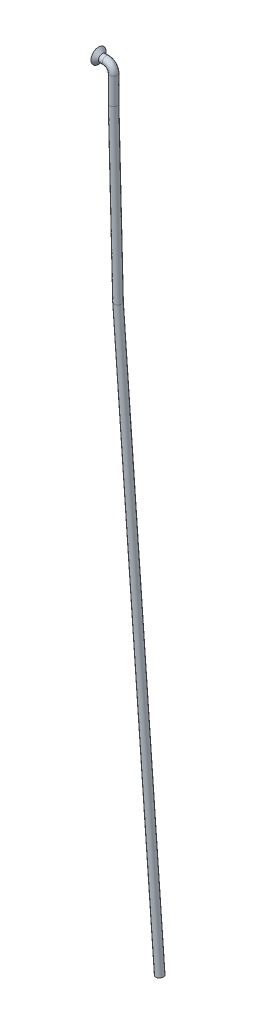
ISO-10303-21;
HEADER;
FILE_DESCRIPTION(('STEP AP214'),'2;1');
FILE_NAME('part.step','',(''),(''),'','','');
FILE_SCHEMA(('AUTOMOTIVE_DESIGN { 1 0 10303 214 1 1 1 1 }'));
ENDSEC;
DATA;
#1=APPLICATION_CONTEXT('core data for automotive mechanical design processes');
#2=APPLICATION_PROTOCOL_DEFINITION('international standard','automotive_design',2000,#1);
#3=PRODUCT_CONTEXT('',#1,'mechanical');
#4=PRODUCT('Part','Part','',(#3));
#5=PRODUCT_RELATED_PRODUCT_CATEGORY('part','',(#4));
#6=PRODUCT_DEFINITION_FORMATION('','',#4);
#7=PRODUCT_DEFINITION_CONTEXT('part definition',#1,'design');
#8=PRODUCT_DEFINITION('design','',#6,#7);
#9=PRODUCT_DEFINITION_SHAPE('','',#8);
#10=(LENGTH_UNIT() NAMED_UNIT(*) SI_UNIT(.MILLI.,.METRE.));
#11=(NAMED_UNIT(*) PLANE_ANGLE_UNIT() SI_UNIT($,.RADIAN.));
#12=(NAMED_UNIT(*) SI_UNIT($,.STERADIAN.) SOLID_ANGLE_UNIT());
#13=UNCERTAINTY_MEASURE_WITH_UNIT(LENGTH_MEASURE(1.E-05),#10,'distance_accuracy_value','');
#14=(GEOMETRIC_REPRESENTATION_CONTEXT(3) GLOBAL_UNCERTAINTY_ASSIGNED_CONTEXT((#13)) GLOBAL_UNIT_ASSIGNED_CONTEXT((#10,
#11,#12)) REPRESENTATION_CONTEXT('',''));
#15=CARTESIAN_POINT('',(0.,0.,0.));
#16=DIRECTION('',(0.,0.,1.));
#17=DIRECTION('',(1.,0.,0.));
#18=AXIS2_PLACEMENT_3D('',#15,#16,#17);
#19=CARTESIAN_POINT('',(1.17796267385448,-53.9845796239002,0.));
#20=DIRECTION('',(0.0739345183772295,-0.99726309818038,0.));
#21=DIRECTION('',(0.997263098180379,0.0739345183772295,0.));
#22=AXIS2_PLACEMENT_3D('',#19,#20,#21);
#23=CYLINDRICAL_SURFACE('',#22,0.999999999999998);
#24=CARTESIAN_POINT('',(1.17796267385448,-53.9845796239002,0.));
#25=DIRECTION('',(0.0500700461448508,-0.99874570861609,0.));
#26=DIRECTION('',(-0.998745708616088,-0.050070046144851,0.));
#27=AXIS2_PLACEMENT_3D('',#24,#25,#26);
#28=ELLIPSE('',#27,1.0002859373211,0.999999999999998);
#29=CARTESIAN_POINT('',(0.178931386566009,-54.0346639869399,0.));
#30=VERTEX_POINT('',#29);
#31=EDGE_CURVE('E38',#30,#30,#28,.T.);
#32=ORIENTED_EDGE('',*,*,#31,.T.);
#33=EDGE_LOOP('',(#32));
#34=FACE_BOUND('',#33,.T.);
#35=CARTESIAN_POINT('',(12.2279626738545,-203.032108122944,0.));
#36=DIRECTION('',(0.0739345183772295,-0.99726309818038,0.));
#37=DIRECTION('',(0.997263098180379,0.0739345183772295,0.));
#38=AXIS2_PLACEMENT_3D('',#35,#36,#37);
#39=CIRCLE('',#38,0.999999999999998);
#40=CARTESIAN_POINT('',(13.2252257720349,-202.958173604567,0.));
#41=VERTEX_POINT('',#40);
#42=EDGE_CURVE('E11',#41,#41,#39,.F.);
#43=ORIENTED_EDGE('',*,*,#42,.T.);
#44=EDGE_LOOP('',(#43));
#45=FACE_BOUND('',#44,.T.);
#46=ADVANCED_FACE('F32',(#34,#45),#23,.T.);
#47=CARTESIAN_POINT('',(0.,-9.00000000000012,0.));
#48=DIRECTION('',(0.0261769483078772,-0.999657324975558,0.));
#49=DIRECTION('',(0.999657324975557,0.0261769483078772,0.));
#50=AXIS2_PLACEMENT_3D('',#47,#48,#49);
#51=CYLINDRICAL_SURFACE('',#50,0.999999999999998);
#52=CARTESIAN_POINT('',(0.,-9.00000000000012,0.));
#53=DIRECTION('',(0.0130895955713465,-0.999914327574008,0.));
#54=DIRECTION('',(-0.999914327574007,-0.0130895955713465,0.));
#55=AXIS2_PLACEMENT_3D('',#52,#53,#54);
#56=ELLIPSE('',#55,1.00008567976638,0.999999999999998);
#57=CARTESIAN_POINT('',(-0.999999999999997,-9.01309071708496,0.));
#58=VERTEX_POINT('',#57);
#59=EDGE_CURVE('E42',#58,#58,#56,.F.);
#60=ORIENTED_EDGE('',*,*,#59,.F.);
#61=EDGE_LOOP('',(#60));
#62=FACE_BOUND('',#61,.T.);
#63=ORIENTED_EDGE('',*,*,#31,.F.);
#64=EDGE_LOOP('',(#63));
#65=FACE_BOUND('',#64,.T.);
#66=ADVANCED_FACE('F79',(#62,#65),#51,.T.);
#67=CARTESIAN_POINT('',(0.,-2.00000000000006,0.));
#68=DIRECTION('',(0.,-1.,0.));
#69=DIRECTION('',(1.,0.,0.));
#70=AXIS2_PLACEMENT_3D('',#67,#68,#69);
#71=CYLINDRICAL_SURFACE('',#70,0.999999999999998);
#72=CARTESIAN_POINT('',(0.,-2.00000000000006,0.));
#73=DIRECTION('',(0.,-1.,0.));
#74=DIRECTION('',(0.,0.,-1.));
#75=AXIS2_PLACEMENT_3D('',#72,#73,#74);
#76=CIRCLE('',#75,0.999999999999998);
#77=CARTESIAN_POINT('',(0.999999999999998,-2.00000000000006,0.));
#78=VERTEX_POINT('',#77);
#79=EDGE_CURVE('E46',#78,#78,#76,.T.);
#80=ORIENTED_EDGE('',*,*,#79,.T.);
#81=EDGE_LOOP('',(#80));
#82=FACE_BOUND('',#81,.T.);
#83=ORIENTED_EDGE('',*,*,#59,.T.);
#84=EDGE_LOOP('',(#83));
#85=FACE_BOUND('',#84,.T.);
#86=ADVANCED_FACE('F83',(#82,#85),#71,.T.);
#87=CARTESIAN_POINT('',(-2.,-2.00000000000006,0.));
#88=DIRECTION('',(0.,0.,-1.));
#89=DIRECTION('',(-1.,0.,0.));
#90=AXIS2_PLACEMENT_3D('',#87,#88,#89);
#91=TOROIDAL_SURFACE('',#90,2.,0.999999999999998);
#92=CARTESIAN_POINT('',(-2.,0.,0.));
#93=DIRECTION('',(1.,0.,0.));
#94=DIRECTION('',(0.,0.,-1.));
#95=AXIS2_PLACEMENT_3D('',#92,#93,#94);
#96=CIRCLE('',#95,0.999999999999998);
#97=CARTESIAN_POINT('',(-2.,0.999999999999941,0.));
#98=VERTEX_POINT('',#97);
#99=EDGE_CURVE('E51',#98,#98,#96,.T.);
#100=CARTESIAN_POINT('',(-2.,-2.00000000000006,0.));
#101=DIRECTION('',(0.,0.,-1.));
#102=DIRECTION('',(-1.,0.,0.));
#103=AXIS2_PLACEMENT_3D('',#100,#101,#102);
#104=CIRCLE('',#103,3.);
#105=EDGE_CURVE('',#98,#78,#104,.T.);
#106=ORIENTED_EDGE('',*,*,#99,.T.);
#107=ORIENTED_EDGE('',*,*,#79,.F.);
#108=ORIENTED_EDGE('',*,*,#105,.T.);
#109=ORIENTED_EDGE('',*,*,#105,.F.);
#110=EDGE_LOOP('',(#106,#108,#107,#109));
#111=FACE_BOUND('',#110,.T.);
#112=ADVANCED_FACE('F88',(#111),#91,.T.);
#113=CARTESIAN_POINT('',(-2.,0.,0.));
#114=DIRECTION('',(-1.,0.,0.));
#115=DIRECTION('',(0.,-1.,0.));
#116=AXIS2_PLACEMENT_3D('',#113,#114,#115);
#117=CYLINDRICAL_SURFACE('',#116,0.999999999999998);
#118=CARTESIAN_POINT('',(-3.,0.,0.));
#119=DIRECTION('',(1.,0.,0.));
#120=DIRECTION('',(0.,1.,0.));
#121=AXIS2_PLACEMENT_3D('',#118,#119,#120);
#122=CIRCLE('',#121,0.999999999999999);
#123=CARTESIAN_POINT('',(-3.,1.,0.));
#124=VERTEX_POINT('',#123);
#125=EDGE_CURVE('E57',#124,#124,#122,.T.);
#126=ORIENTED_EDGE('',*,*,#125,.T.);
#127=EDGE_LOOP('',(#126));
#128=FACE_BOUND('',#127,.T.);
#129=ORIENTED_EDGE('',*,*,#99,.F.);
#130=EDGE_LOOP('',(#129));
#131=FACE_BOUND('',#130,.T.);
#132=ADVANCED_FACE('F61',(#128,#131),#117,.T.);
#133=CARTESIAN_POINT('',(12.2279626738545,-203.032108122944,0.));
#134=DIRECTION('',(0.0739345183772295,-0.99726309818038,0.));
#135=DIRECTION('',(0.997263098180379,0.0739345183772295,0.));
#136=AXIS2_PLACEMENT_3D('',#133,#134,#135);
#137=PLANE('',#136);
#138=ORIENTED_EDGE('',*,*,#42,.F.);
#139=EDGE_LOOP('',(#138));
#140=FACE_BOUND('',#139,.T.);
#141=ADVANCED_FACE('F67',(#140),#137,.T.);
#142=CARTESIAN_POINT('',(-3.,0.,0.));
#143=DIRECTION('',(-1.,0.,0.));
#144=DIRECTION('',(0.,-1.,0.));
#145=AXIS2_PLACEMENT_3D('',#142,#143,#144);
#146=CONICAL_SURFACE('',#145,0.999999999999999,0.785398163397449);
#147=CARTESIAN_POINT('',(-4.,0.,0.));
#148=DIRECTION('',(1.,0.,0.));
#149=DIRECTION('',(0.,1.,0.));
#150=AXIS2_PLACEMENT_3D('',#147,#148,#149);
#151=CIRCLE('',#150,2.);
#152=CARTESIAN_POINT('',(-4.,2.,0.));
#153=VERTEX_POINT('',#152);
#154=EDGE_CURVE('E54',#153,#153,#151,.T.);
#155=ORIENTED_EDGE('',*,*,#154,.T.);
#156=EDGE_LOOP('',(#155));
#157=FACE_BOUND('',#156,.T.);
#158=ORIENTED_EDGE('',*,*,#125,.F.);
#159=EDGE_LOOP('',(#158));
#160=FACE_BOUND('',#159,.T.);
#161=ADVANCED_FACE('F64',(#157,#160),#146,.T.);
#162=CARTESIAN_POINT('',(-4.,0.,0.));
#163=DIRECTION('',(1.,0.,0.));
#164=DIRECTION('',(0.,0.,-1.));
#165=AXIS2_PLACEMENT_3D('',#162,#163,#164);
#166=PLANE('',#165);
#167=ORIENTED_EDGE('',*,*,#154,.F.);
#168=EDGE_LOOP('',(#167));
#169=FACE_BOUND('',#168,.T.);
#170=ADVANCED_FACE('F66',(#169),#166,.F.);
#171=CLOSED_SHELL('',(#46,#66,#86,#112,#132,#141,#161,#170));
#172=MANIFOLD_SOLID_BREP('B2',#171);
#173=ADVANCED_BREP_SHAPE_REPRESENTATION('',(#18,#172),#14);
#174=SHAPE_DEFINITION_REPRESENTATION(#9,#173);
ENDSEC;
END-ISO-10303-21;
